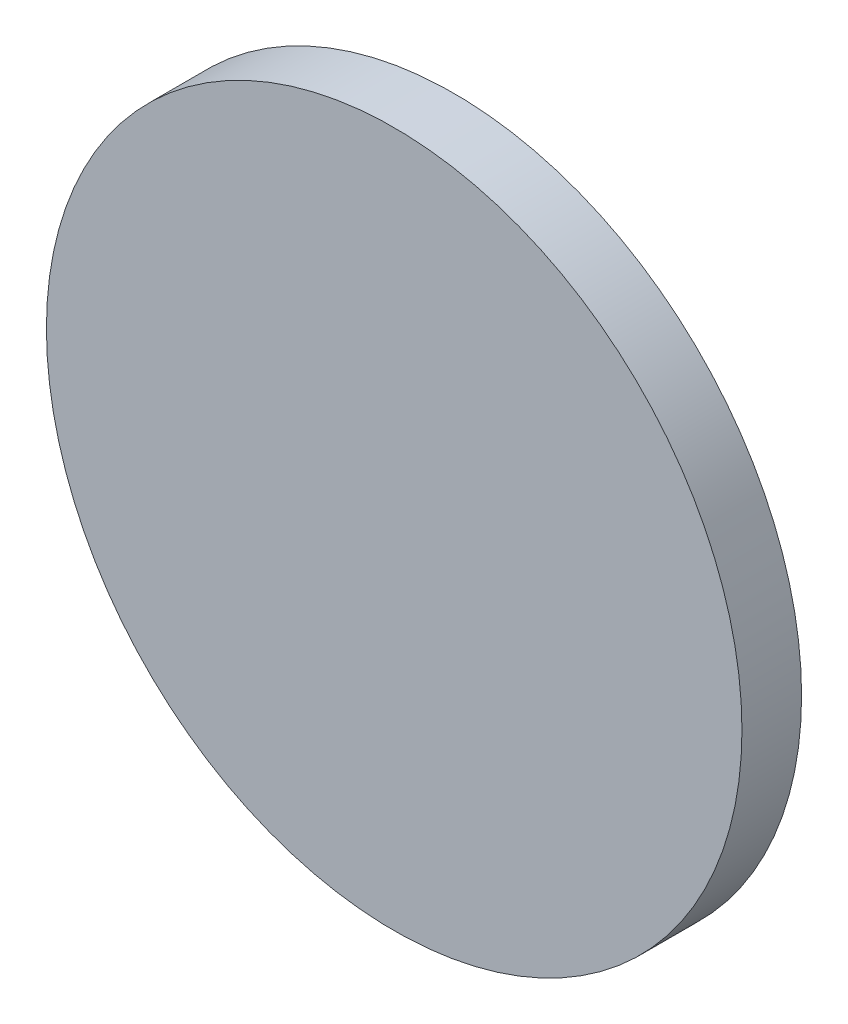
ISO-10303-21;
HEADER;
FILE_DESCRIPTION(('STEP AP214'),'2;1');
FILE_NAME('part.step','',(''),(''),'','','');
FILE_SCHEMA(('AUTOMOTIVE_DESIGN { 1 0 10303 214 1 1 1 1 }'));
ENDSEC;
DATA;
#1=APPLICATION_CONTEXT('core data for automotive mechanical design processes');
#2=APPLICATION_PROTOCOL_DEFINITION('international standard','automotive_design',2000,#1);
#3=PRODUCT_CONTEXT('',#1,'mechanical');
#4=PRODUCT('Part','Part','',(#3));
#5=PRODUCT_RELATED_PRODUCT_CATEGORY('part','',(#4));
#6=PRODUCT_DEFINITION_FORMATION('','',#4);
#7=PRODUCT_DEFINITION_CONTEXT('part definition',#1,'design');
#8=PRODUCT_DEFINITION('design','',#6,#7);
#9=PRODUCT_DEFINITION_SHAPE('','',#8);
#10=(LENGTH_UNIT() NAMED_UNIT(*) SI_UNIT(.MILLI.,.METRE.));
#11=(NAMED_UNIT(*) PLANE_ANGLE_UNIT() SI_UNIT($,.RADIAN.));
#12=(NAMED_UNIT(*) SI_UNIT($,.STERADIAN.) SOLID_ANGLE_UNIT());
#13=UNCERTAINTY_MEASURE_WITH_UNIT(LENGTH_MEASURE(1.E-05),#10,'distance_accuracy_value','');
#14=(GEOMETRIC_REPRESENTATION_CONTEXT(3) GLOBAL_UNCERTAINTY_ASSIGNED_CONTEXT((#13)) GLOBAL_UNIT_ASSIGNED_CONTEXT((#10,
#11,#12)) REPRESENTATION_CONTEXT('',''));
#15=CARTESIAN_POINT('',(0.,0.,0.));
#16=DIRECTION('',(0.,0.,1.));
#17=DIRECTION('',(1.,0.,0.));
#18=AXIS2_PLACEMENT_3D('',#15,#16,#17);
#19=CARTESIAN_POINT('',(1.63322,6.197600006176,0.76487));
#20=DIRECTION('',(0.,0.,-1.));
#21=DIRECTION('',(-1.,0.,0.));
#22=AXIS2_PLACEMENT_3D('',#19,#20,#21);
#23=PLANE('',#22);
#24=CARTESIAN_POINT('',(1.63322,6.197600006176,0.76487));
#25=DIRECTION('',(0.,0.,1.));
#26=DIRECTION('',(1.,0.,0.));
#27=AXIS2_PLACEMENT_3D('',#24,#25,#26);
#28=CIRCLE('',#27,0.200024667);
#29=CARTESIAN_POINT('',(1.833244667,6.197600006176,0.76487));
#30=VERTEX_POINT('',#29);
#31=EDGE_CURVE('E18',#30,#30,#28,.T.);
#32=ORIENTED_EDGE('',*,*,#31,.F.);
#33=EDGE_LOOP('',(#32));
#34=FACE_BOUND('',#33,.T.);
#35=ADVANCED_FACE('F15',(#34),#23,.T.);
#36=CARTESIAN_POINT('',(1.63322,6.197600006176,0.76487));
#37=DIRECTION('',(0.,0.,1.));
#38=DIRECTION('',(1.,0.,0.));
#39=AXIS2_PLACEMENT_3D('',#36,#37,#38);
#40=CYLINDRICAL_SURFACE('',#39,0.200024667);
#41=CARTESIAN_POINT('',(1.63322,6.197600006176,0.79916));
#42=DIRECTION('',(0.,0.,1.));
#43=DIRECTION('',(1.,0.,0.));
#44=AXIS2_PLACEMENT_3D('',#41,#42,#43);
#45=CIRCLE('',#44,0.200024667);
#46=CARTESIAN_POINT('',(1.833244667,6.197600006176,0.79916));
#47=VERTEX_POINT('',#46);
#48=EDGE_CURVE('E10',#47,#47,#45,.T.);
#49=ORIENTED_EDGE('',*,*,#48,.F.);
#50=EDGE_LOOP('',(#49));
#51=FACE_BOUND('',#50,.T.);
#52=ORIENTED_EDGE('',*,*,#31,.T.);
#53=EDGE_LOOP('',(#52));
#54=FACE_BOUND('',#53,.T.);
#55=ADVANCED_FACE('F27',(#51,#54),#40,.T.);
#56=CARTESIAN_POINT('',(1.63322,6.197600006176,0.79916));
#57=DIRECTION('',(0.,0.,1.));
#58=DIRECTION('',(1.,0.,0.));
#59=AXIS2_PLACEMENT_3D('',#56,#57,#58);
#60=PLANE('',#59);
#61=ORIENTED_EDGE('',*,*,#48,.T.);
#62=EDGE_LOOP('',(#61));
#63=FACE_BOUND('',#62,.T.);
#64=ADVANCED_FACE('F34',(#63),#60,.T.);
#65=CLOSED_SHELL('',(#35,#55,#64));
#66=MANIFOLD_SOLID_BREP('B1',#65);
#67=ADVANCED_BREP_SHAPE_REPRESENTATION('',(#18,#66),#14);
#68=SHAPE_DEFINITION_REPRESENTATION(#9,#67);
ENDSEC;
END-ISO-10303-21;
